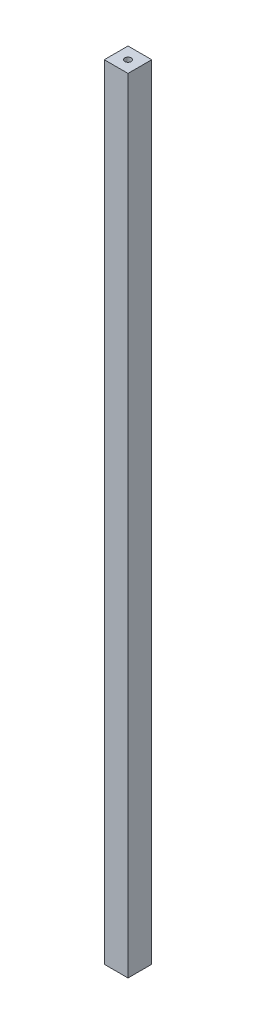
ISO-10303-21;
HEADER;
FILE_DESCRIPTION(('STEP AP214'),'2;1');
FILE_NAME('part.step','',(''),(''),'','','');
FILE_SCHEMA(('AUTOMOTIVE_DESIGN { 1 0 10303 214 1 1 1 1 }'));
ENDSEC;
DATA;
#1=APPLICATION_CONTEXT('core data for automotive mechanical design processes');
#2=APPLICATION_PROTOCOL_DEFINITION('international standard','automotive_design',2000,#1);
#3=PRODUCT_CONTEXT('',#1,'mechanical');
#4=PRODUCT('Part','Part','',(#3));
#5=PRODUCT_RELATED_PRODUCT_CATEGORY('part','',(#4));
#6=PRODUCT_DEFINITION_FORMATION('','',#4);
#7=PRODUCT_DEFINITION_CONTEXT('part definition',#1,'design');
#8=PRODUCT_DEFINITION('design','',#6,#7);
#9=PRODUCT_DEFINITION_SHAPE('','',#8);
#10=(LENGTH_UNIT() NAMED_UNIT(*) SI_UNIT(.MILLI.,.METRE.));
#11=(NAMED_UNIT(*) PLANE_ANGLE_UNIT() SI_UNIT($,.RADIAN.));
#12=(NAMED_UNIT(*) SI_UNIT($,.STERADIAN.) SOLID_ANGLE_UNIT());
#13=UNCERTAINTY_MEASURE_WITH_UNIT(LENGTH_MEASURE(1.E-05),#10,'distance_accuracy_value','');
#14=(GEOMETRIC_REPRESENTATION_CONTEXT(3) GLOBAL_UNCERTAINTY_ASSIGNED_CONTEXT((#13)) GLOBAL_UNIT_ASSIGNED_CONTEXT((#10,
#11,#12)) REPRESENTATION_CONTEXT('',''));
#15=CARTESIAN_POINT('',(0.,0.,0.));
#16=DIRECTION('',(0.,0.,1.));
#17=DIRECTION('',(1.,0.,0.));
#18=AXIS2_PLACEMENT_3D('',#15,#16,#17);
#19=CARTESIAN_POINT('',(0.,330.,0.));
#20=DIRECTION('',(1.,0.,0.));
#21=DIRECTION('',(0.,0.,-1.));
#22=AXIS2_PLACEMENT_3D('',#19,#20,#21);
#23=PLANE('',#22);
#24=DIRECTION('',(0.,0.,1.));
#25=VECTOR('',#24,1.);
#26=CARTESIAN_POINT('',(0.,0.,0.));
#27=LINE('',#26,#25);
#28=CARTESIAN_POINT('',(0.,0.,-10.));
#29=VERTEX_POINT('',#28);
#30=CARTESIAN_POINT('',(0.,0.,0.));
#31=VERTEX_POINT('',#30);
#32=EDGE_CURVE('E97',#29,#31,#27,.T.);
#33=ORIENTED_EDGE('',*,*,#32,.T.);
#34=DIRECTION('',(0.,-1.,0.));
#35=VECTOR('',#34,1.);
#36=CARTESIAN_POINT('',(0.,330.,0.));
#37=LINE('',#36,#35);
#38=CARTESIAN_POINT('',(0.,330.,0.));
#39=VERTEX_POINT('',#38);
#40=EDGE_CURVE('E11',#39,#31,#37,.T.);
#41=ORIENTED_EDGE('',*,*,#40,.F.);
#42=DIRECTION('',(0.,0.,1.));
#43=VECTOR('',#42,1.);
#44=CARTESIAN_POINT('',(0.,330.,0.));
#45=LINE('',#44,#43);
#46=CARTESIAN_POINT('',(0.,330.,-10.));
#47=VERTEX_POINT('',#46);
#48=EDGE_CURVE('E85',#47,#39,#45,.T.);
#49=ORIENTED_EDGE('',*,*,#48,.F.);
#50=DIRECTION('',(0.,-1.,0.));
#51=VECTOR('',#50,1.);
#52=CARTESIAN_POINT('',(0.,330.,-10.));
#53=LINE('',#52,#51);
#54=EDGE_CURVE('E93',#47,#29,#53,.T.);
#55=ORIENTED_EDGE('',*,*,#54,.T.);
#56=EDGE_LOOP('',(#33,#41,#49,#55));
#57=FACE_BOUND('',#56,.T.);
#58=ADVANCED_FACE('F34',(#57),#23,.F.);
#59=CARTESIAN_POINT('',(0.,330.,0.));
#60=DIRECTION('',(0.,0.,-1.));
#61=DIRECTION('',(-1.,0.,0.));
#62=AXIS2_PLACEMENT_3D('',#59,#60,#61);
#63=PLANE('',#62);
#64=DIRECTION('',(1.,0.,0.));
#65=VECTOR('',#64,1.);
#66=CARTESIAN_POINT('',(0.,0.,0.));
#67=LINE('',#66,#65);
#68=CARTESIAN_POINT('',(10.,0.,0.));
#69=VERTEX_POINT('',#68);
#70=EDGE_CURVE('E89',#31,#69,#67,.T.);
#71=ORIENTED_EDGE('',*,*,#70,.T.);
#72=DIRECTION('',(0.,-1.,0.));
#73=VECTOR('',#72,1.);
#74=CARTESIAN_POINT('',(10.,330.,0.));
#75=LINE('',#74,#73);
#76=CARTESIAN_POINT('',(10.,330.,0.));
#77=VERTEX_POINT('',#76);
#78=EDGE_CURVE('E42',#77,#69,#75,.T.);
#79=ORIENTED_EDGE('',*,*,#78,.F.);
#80=DIRECTION('',(1.,0.,0.));
#81=VECTOR('',#80,1.);
#82=CARTESIAN_POINT('',(0.,330.,0.));
#83=LINE('',#82,#81);
#84=EDGE_CURVE('E80',#39,#77,#83,.T.);
#85=ORIENTED_EDGE('',*,*,#84,.F.);
#86=ORIENTED_EDGE('',*,*,#40,.T.);
#87=EDGE_LOOP('',(#71,#79,#85,#86));
#88=FACE_BOUND('',#87,.T.);
#89=ADVANCED_FACE('F88',(#88),#63,.F.);
#90=CARTESIAN_POINT('',(10.,330.,0.));
#91=DIRECTION('',(-1.,0.,0.));
#92=DIRECTION('',(0.,0.,1.));
#93=AXIS2_PLACEMENT_3D('',#90,#91,#92);
#94=PLANE('',#93);
#95=DIRECTION('',(0.,0.,-1.));
#96=VECTOR('',#95,1.);
#97=CARTESIAN_POINT('',(10.,0.,0.));
#98=LINE('',#97,#96);
#99=CARTESIAN_POINT('',(10.,0.,-10.));
#100=VERTEX_POINT('',#99);
#101=EDGE_CURVE('E67',#69,#100,#98,.T.);
#102=ORIENTED_EDGE('',*,*,#101,.T.);
#103=DIRECTION('',(0.,-1.,0.));
#104=VECTOR('',#103,1.);
#105=CARTESIAN_POINT('',(10.,330.,-10.));
#106=LINE('',#105,#104);
#107=CARTESIAN_POINT('',(10.,330.,-10.));
#108=VERTEX_POINT('',#107);
#109=EDGE_CURVE('E90',#108,#100,#106,.T.);
#110=ORIENTED_EDGE('',*,*,#109,.F.);
#111=DIRECTION('',(0.,0.,-1.));
#112=VECTOR('',#111,1.);
#113=CARTESIAN_POINT('',(10.,330.,0.));
#114=LINE('',#113,#112);
#115=EDGE_CURVE('E83',#77,#108,#114,.T.);
#116=ORIENTED_EDGE('',*,*,#115,.F.);
#117=ORIENTED_EDGE('',*,*,#78,.T.);
#118=EDGE_LOOP('',(#102,#110,#116,#117));
#119=FACE_BOUND('',#118,.T.);
#120=ADVANCED_FACE('F91',(#119),#94,.F.);
#121=CARTESIAN_POINT('',(0.,330.,-10.));
#122=DIRECTION('',(0.,0.,1.));
#123=DIRECTION('',(1.,0.,0.));
#124=AXIS2_PLACEMENT_3D('',#121,#122,#123);
#125=PLANE('',#124);
#126=DIRECTION('',(-1.,0.,0.));
#127=VECTOR('',#126,1.);
#128=CARTESIAN_POINT('',(0.,0.,-10.));
#129=LINE('',#128,#127);
#130=EDGE_CURVE('E73',#100,#29,#129,.T.);
#131=ORIENTED_EDGE('',*,*,#130,.T.);
#132=ORIENTED_EDGE('',*,*,#54,.F.);
#133=DIRECTION('',(-1.,0.,0.));
#134=VECTOR('',#133,1.);
#135=CARTESIAN_POINT('',(0.,330.,-10.));
#136=LINE('',#135,#134);
#137=EDGE_CURVE('E50',#108,#47,#136,.T.);
#138=ORIENTED_EDGE('',*,*,#137,.F.);
#139=ORIENTED_EDGE('',*,*,#109,.T.);
#140=EDGE_LOOP('',(#131,#132,#138,#139));
#141=FACE_BOUND('',#140,.T.);
#142=ADVANCED_FACE('F105',(#141),#125,.F.);
#143=CARTESIAN_POINT('',(0.,330.,0.));
#144=DIRECTION('',(0.,-1.,0.));
#145=DIRECTION('',(0.,0.,-1.));
#146=AXIS2_PLACEMENT_3D('',#143,#144,#145);
#147=PLANE('',#146);
#148=CARTESIAN_POINT('',(5.,330.,-5.));
#149=DIRECTION('',(0.,1.,0.));
#150=DIRECTION('',(0.,0.,1.));
#151=AXIS2_PLACEMENT_3D('',#148,#149,#150);
#152=CIRCLE('',#151,1.35254999999996);
#153=CARTESIAN_POINT('',(5.,330.,-3.64745000000004));
#154=VERTEX_POINT('',#153);
#155=EDGE_CURVE('E113',#154,#154,#152,.T.);
#156=ORIENTED_EDGE('',*,*,#155,.F.);
#157=EDGE_LOOP('',(#156));
#158=FACE_BOUND('',#157,.T.);
#159=ORIENTED_EDGE('',*,*,#48,.T.);
#160=ORIENTED_EDGE('',*,*,#84,.T.);
#161=ORIENTED_EDGE('',*,*,#115,.T.);
#162=ORIENTED_EDGE('',*,*,#137,.T.);
#163=EDGE_LOOP('',(#159,#160,#161,#162));
#164=FACE_BOUND('',#163,.T.);
#165=ADVANCED_FACE('F81',(#158,#164),#147,.F.);
#166=CARTESIAN_POINT('',(0.,0.,0.));
#167=DIRECTION('',(0.,-1.,0.));
#168=DIRECTION('',(0.,0.,-1.));
#169=AXIS2_PLACEMENT_3D('',#166,#167,#168);
#170=PLANE('',#169);
#171=CARTESIAN_POINT('',(5.,0.,-5.));
#172=DIRECTION('',(0.,1.,0.));
#173=DIRECTION('',(0.,0.,1.));
#174=AXIS2_PLACEMENT_3D('',#171,#172,#173);
#175=CIRCLE('',#174,1.35254999999992);
#176=CARTESIAN_POINT('',(5.,0.,-3.64745000000008));
#177=VERTEX_POINT('',#176);
#178=EDGE_CURVE('E100',#177,#177,#175,.T.);
#179=ORIENTED_EDGE('',*,*,#178,.T.);
#180=EDGE_LOOP('',(#179));
#181=FACE_BOUND('',#180,.T.);
#182=ORIENTED_EDGE('',*,*,#32,.F.);
#183=ORIENTED_EDGE('',*,*,#130,.F.);
#184=ORIENTED_EDGE('',*,*,#101,.F.);
#185=ORIENTED_EDGE('',*,*,#70,.F.);
#186=EDGE_LOOP('',(#182,#183,#184,#185));
#187=FACE_BOUND('',#186,.T.);
#188=ADVANCED_FACE('F108',(#181,#187),#170,.T.);
#189=CARTESIAN_POINT('',(5.,330.,-5.));
#190=DIRECTION('',(0.,1.,0.));
#191=DIRECTION('',(0.,0.,1.));
#192=AXIS2_PLACEMENT_3D('',#189,#190,#191);
#193=CYLINDRICAL_SURFACE('',#192,1.35254999999994);
#194=ORIENTED_EDGE('',*,*,#178,.F.);
#195=EDGE_LOOP('',(#194));
#196=FACE_BOUND('',#195,.T.);
#197=ORIENTED_EDGE('',*,*,#155,.T.);
#198=EDGE_LOOP('',(#197));
#199=FACE_BOUND('',#198,.T.);
#200=ADVANCED_FACE('F117',(#196,#199),#193,.F.);
#201=CLOSED_SHELL('',(#58,#89,#120,#142,#165,#188,#200));
#202=MANIFOLD_SOLID_BREP('B2',#201);
#203=ADVANCED_BREP_SHAPE_REPRESENTATION('',(#18,#202),#14);
#204=SHAPE_DEFINITION_REPRESENTATION(#9,#203);
ENDSEC;
END-ISO-10303-21;
